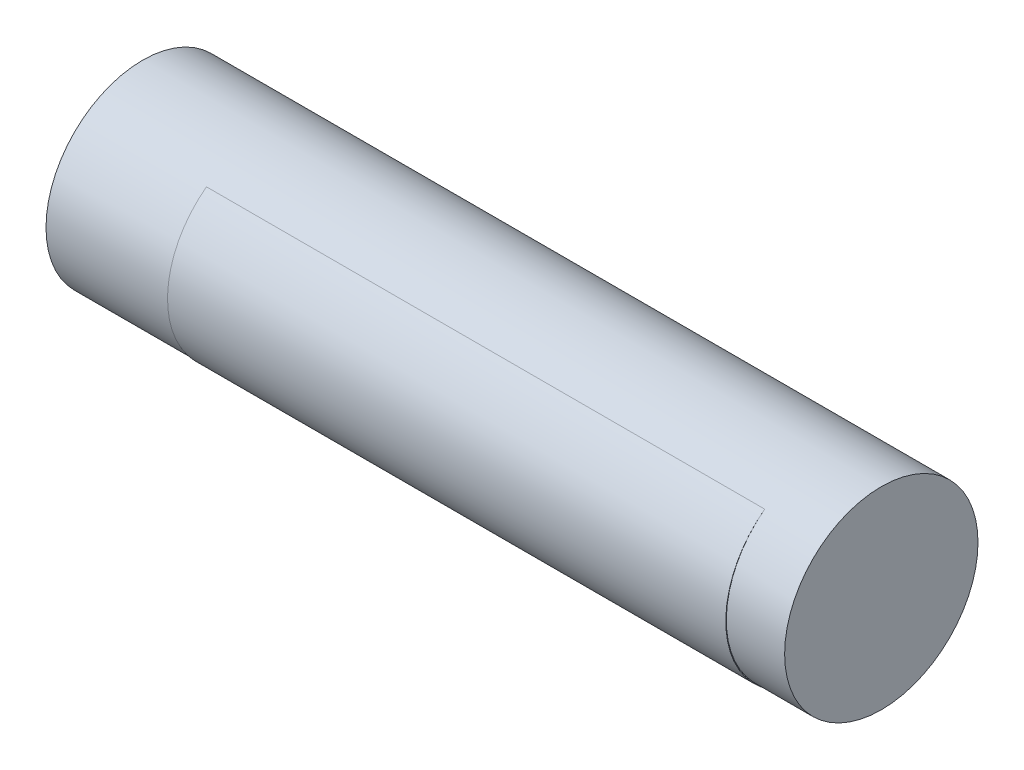
ISO-10303-21;
HEADER;
FILE_DESCRIPTION(('STEP AP214'),'2;1');
FILE_NAME('part.step','',(''),(''),'','','');
FILE_SCHEMA(('AUTOMOTIVE_DESIGN { 1 0 10303 214 1 1 1 1 }'));
ENDSEC;
DATA;
#1=APPLICATION_CONTEXT('core data for automotive mechanical design processes');
#2=APPLICATION_PROTOCOL_DEFINITION('international standard','automotive_design',2000,#1);
#3=PRODUCT_CONTEXT('',#1,'mechanical');
#4=PRODUCT('Part','Part','',(#3));
#5=PRODUCT_RELATED_PRODUCT_CATEGORY('part','',(#4));
#6=PRODUCT_DEFINITION_FORMATION('','',#4);
#7=PRODUCT_DEFINITION_CONTEXT('part definition',#1,'design');
#8=PRODUCT_DEFINITION('design','',#6,#7);
#9=PRODUCT_DEFINITION_SHAPE('','',#8);
#10=(LENGTH_UNIT() NAMED_UNIT(*) SI_UNIT(.MILLI.,.METRE.));
#11=(NAMED_UNIT(*) PLANE_ANGLE_UNIT() SI_UNIT($,.RADIAN.));
#12=(NAMED_UNIT(*) SI_UNIT($,.STERADIAN.) SOLID_ANGLE_UNIT());
#13=UNCERTAINTY_MEASURE_WITH_UNIT(LENGTH_MEASURE(1.E-05),#10,'distance_accuracy_value','');
#14=(GEOMETRIC_REPRESENTATION_CONTEXT(3) GLOBAL_UNCERTAINTY_ASSIGNED_CONTEXT((#13)) GLOBAL_UNIT_ASSIGNED_CONTEXT((#10,
#11,#12)) REPRESENTATION_CONTEXT('',''));
#15=CARTESIAN_POINT('',(0.,0.,0.));
#16=DIRECTION('',(0.,0.,1.));
#17=DIRECTION('',(1.,0.,0.));
#18=AXIS2_PLACEMENT_3D('',#15,#16,#17);
#19=CARTESIAN_POINT('',(-73.152,0.,0.));
#20=DIRECTION('',(1.,0.,0.));
#21=DIRECTION('',(0.,0.,-1.));
#22=AXIS2_PLACEMENT_3D('',#19,#20,#21);
#23=PLANE('',#22);
#24=CARTESIAN_POINT('',(-73.152,3.88200271940749,-0.106266077025886));
#25=DIRECTION('',(1.,0.,0.));
#26=DIRECTION('',(0.,0.,-1.));
#27=AXIS2_PLACEMENT_3D('',#24,#25,#26);
#28=CIRCLE('',#27,19.05);
#29=CARTESIAN_POINT('',(-73.152,3.88200271940749,-19.1562660770259));
#30=VERTEX_POINT('',#29);
#31=EDGE_CURVE('E93',#30,#30,#28,.T.);
#32=ORIENTED_EDGE('',*,*,#31,.F.);
#33=EDGE_LOOP('',(#32));
#34=FACE_BOUND('',#33,.T.);
#35=ADVANCED_FACE('F52',(#34),#23,.F.);
#36=CARTESIAN_POINT('',(0.,3.88200271940749,-0.106266077025886));
#37=DIRECTION('',(-1.,0.,0.));
#38=DIRECTION('',(0.,0.,1.));
#39=AXIS2_PLACEMENT_3D('',#36,#37,#38);
#40=CYLINDRICAL_SURFACE('',#39,19.05);
#41=CARTESIAN_POINT('',(-49.0995017688133,3.88200271940749,-0.106266077025886));
#42=DIRECTION('',(-1.,0.,0.));
#43=DIRECTION('',(0.,0.,1.));
#44=AXIS2_PLACEMENT_3D('',#41,#42,#43);
#45=CIRCLE('',#44,19.05);
#46=CARTESIAN_POINT('',(-49.0995017688133,19.0820603182075,11.3767974947376));
#47=VERTEX_POINT('',#46);
#48=CARTESIAN_POINT('',(-49.0995017688133,-11.397754437153,-11.4830635717754));
#49=VERTEX_POINT('',#48);
#50=EDGE_CURVE('E86',#47,#49,#45,.F.);
#51=ORIENTED_EDGE('',*,*,#50,.F.);
#52=DIRECTION('',(-1.,0.,0.));
#53=VECTOR('',#52,1.);
#54=CARTESIAN_POINT('',(-0.381000000000007,19.0820603182075,11.3767974947376));
#55=LINE('',#54,#53);
#56=CARTESIAN_POINT('',(60.9004982311867,19.0820603182075,11.3767974947376));
#57=VERTEX_POINT('',#56);
#58=EDGE_CURVE('E67',#57,#47,#55,.T.);
#59=ORIENTED_EDGE('',*,*,#58,.F.);
#60=CARTESIAN_POINT('',(60.9004982311867,3.88200271940749,-0.106266077025886));
#61=DIRECTION('',(1.,0.,0.));
#62=DIRECTION('',(0.,0.,-1.));
#63=AXIS2_PLACEMENT_3D('',#60,#61,#62);
#64=CIRCLE('',#63,19.05);
#65=CARTESIAN_POINT('',(60.9004982311867,-11.397754437153,-11.4830635717754));
#66=VERTEX_POINT('',#65);
#67=EDGE_CURVE('E12',#66,#57,#64,.F.);
#68=ORIENTED_EDGE('',*,*,#67,.F.);
#69=DIRECTION('',(-1.,0.,0.));
#70=VECTOR('',#69,1.);
#71=CARTESIAN_POINT('',(-0.381000000000007,-11.397754437153,-11.4830635717754));
#72=LINE('',#71,#70);
#73=EDGE_CURVE('E71',#49,#66,#72,.F.);
#74=ORIENTED_EDGE('',*,*,#73,.F.);
#75=EDGE_LOOP('',(#51,#59,#68,#74));
#76=FACE_BOUND('',#75,.T.);
#77=ORIENTED_EDGE('',*,*,#31,.T.);
#78=EDGE_LOOP('',(#77));
#79=FACE_BOUND('',#78,.T.);
#80=CARTESIAN_POINT('',(72.39,3.88200271940749,-0.106266077025886));
#81=DIRECTION('',(1.,0.,0.));
#82=DIRECTION('',(0.,0.,-1.));
#83=AXIS2_PLACEMENT_3D('',#80,#81,#82);
#84=CIRCLE('',#83,19.05);
#85=CARTESIAN_POINT('',(72.39,3.88200271940749,-19.1562660770259));
#86=VERTEX_POINT('',#85);
#87=EDGE_CURVE('E96',#86,#86,#84,.T.);
#88=ORIENTED_EDGE('',*,*,#87,.F.);
#89=EDGE_LOOP('',(#88));
#90=FACE_BOUND('',#89,.T.);
#91=ADVANCED_FACE('F76',(#76,#79,#90),#40,.T.);
#92=CARTESIAN_POINT('',(72.39,0.,0.));
#93=DIRECTION('',(1.,0.,0.));
#94=DIRECTION('',(0.,0.,-1.));
#95=AXIS2_PLACEMENT_3D('',#92,#93,#94);
#96=PLANE('',#95);
#97=ORIENTED_EDGE('',*,*,#87,.T.);
#98=EDGE_LOOP('',(#97));
#99=FACE_BOUND('',#98,.T.);
#100=ADVANCED_FACE('F100',(#99),#96,.T.);
#101=CARTESIAN_POINT('',(-49.0995017688133,3.8023031616381,0.));
#102=DIRECTION('',(-1.,0.,0.));
#103=DIRECTION('',(0.,0.,1.));
#104=AXIS2_PLACEMENT_3D('',#101,#102,#103);
#105=CYLINDRICAL_SURFACE('',#104,19.0500000000001);
#106=CARTESIAN_POINT('',(-49.0995017688133,3.8023031616381,0.));
#107=DIRECTION('',(-1.,0.,0.));
#108=DIRECTION('',(0.,0.,1.));
#109=AXIS2_PLACEMENT_3D('',#106,#107,#108);
#110=CIRCLE('',#109,19.0500000000001);
#111=EDGE_CURVE('E60',#49,#47,#110,.T.);
#112=ORIENTED_EDGE('',*,*,#111,.F.);
#113=ORIENTED_EDGE('',*,*,#73,.T.);
#114=CARTESIAN_POINT('',(60.9004982311867,3.8023031616381,0.));
#115=DIRECTION('',(-1.,0.,0.));
#116=DIRECTION('',(0.,0.,1.));
#117=AXIS2_PLACEMENT_3D('',#114,#115,#116);
#118=CIRCLE('',#117,19.0500000000001);
#119=EDGE_CURVE('E84',#66,#57,#118,.T.);
#120=ORIENTED_EDGE('',*,*,#119,.T.);
#121=ORIENTED_EDGE('',*,*,#58,.T.);
#122=EDGE_LOOP('',(#112,#113,#120,#121));
#123=FACE_BOUND('',#122,.T.);
#124=ADVANCED_FACE('F83',(#123),#105,.T.);
#125=CARTESIAN_POINT('',(-49.0995017688133,3.8023031616381,0.));
#126=DIRECTION('',(-1.,0.,0.));
#127=DIRECTION('',(0.,0.,1.));
#128=AXIS2_PLACEMENT_3D('',#125,#126,#127);
#129=PLANE('',#128);
#130=ORIENTED_EDGE('',*,*,#111,.T.);
#131=ORIENTED_EDGE('',*,*,#50,.T.);
#132=EDGE_LOOP('',(#130,#131));
#133=FACE_BOUND('',#132,.T.);
#134=ADVANCED_FACE('F54',(#133),#129,.T.);
#135=CARTESIAN_POINT('',(60.9004982311867,3.8023031616381,0.));
#136=DIRECTION('',(1.,0.,0.));
#137=DIRECTION('',(0.,0.,-1.));
#138=AXIS2_PLACEMENT_3D('',#135,#136,#137);
#139=PLANE('',#138);
#140=ORIENTED_EDGE('',*,*,#119,.F.);
#141=ORIENTED_EDGE('',*,*,#67,.T.);
#142=EDGE_LOOP('',(#140,#141));
#143=FACE_BOUND('',#142,.T.);
#144=ADVANCED_FACE('F88',(#143),#139,.T.);
#145=CLOSED_SHELL('',(#35,#91,#100,#124,#134,#144));
#146=MANIFOLD_SOLID_BREP('B2',#145);
#147=ADVANCED_BREP_SHAPE_REPRESENTATION('',(#18,#146),#14);
#148=SHAPE_DEFINITION_REPRESENTATION(#9,#147);
ENDSEC;
END-ISO-10303-21;
